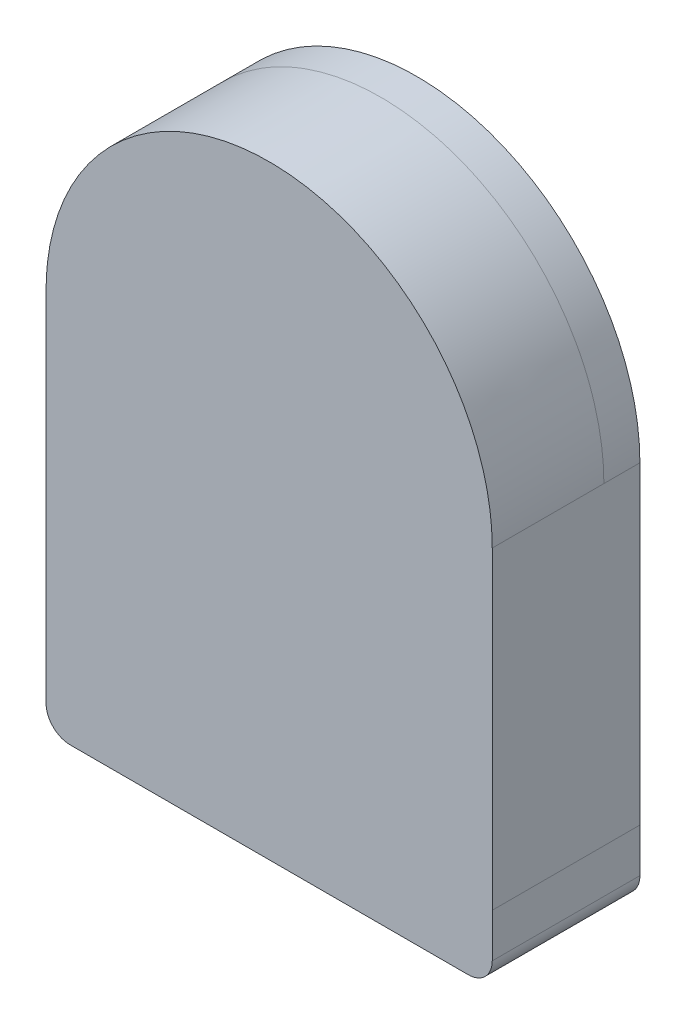
ISO-10303-21;
HEADER;
FILE_DESCRIPTION(('STEP AP214'),'2;1');
FILE_NAME('part.step','',(''),(''),'','','');
FILE_SCHEMA(('AUTOMOTIVE_DESIGN { 1 0 10303 214 1 1 1 1 }'));
ENDSEC;
DATA;
#1=APPLICATION_CONTEXT('core data for automotive mechanical design processes');
#2=APPLICATION_PROTOCOL_DEFINITION('international standard','automotive_design',2000,#1);
#3=PRODUCT_CONTEXT('',#1,'mechanical');
#4=PRODUCT('Part','Part','',(#3));
#5=PRODUCT_RELATED_PRODUCT_CATEGORY('part','',(#4));
#6=PRODUCT_DEFINITION_FORMATION('','',#4);
#7=PRODUCT_DEFINITION_CONTEXT('part definition',#1,'design');
#8=PRODUCT_DEFINITION('design','',#6,#7);
#9=PRODUCT_DEFINITION_SHAPE('','',#8);
#10=(LENGTH_UNIT() NAMED_UNIT(*) SI_UNIT(.MILLI.,.METRE.));
#11=(NAMED_UNIT(*) PLANE_ANGLE_UNIT() SI_UNIT($,.RADIAN.));
#12=(NAMED_UNIT(*) SI_UNIT($,.STERADIAN.) SOLID_ANGLE_UNIT());
#13=UNCERTAINTY_MEASURE_WITH_UNIT(LENGTH_MEASURE(1.E-05),#10,'distance_accuracy_value','');
#14=(GEOMETRIC_REPRESENTATION_CONTEXT(3) GLOBAL_UNCERTAINTY_ASSIGNED_CONTEXT((#13)) GLOBAL_UNIT_ASSIGNED_CONTEXT((#10,
#11,#12)) REPRESENTATION_CONTEXT('',''));
#15=CARTESIAN_POINT('',(0.,0.,0.));
#16=DIRECTION('',(0.,0.,1.));
#17=DIRECTION('',(1.,0.,0.));
#18=AXIS2_PLACEMENT_3D('',#15,#16,#17);
#19=CARTESIAN_POINT('',(8.29127246754,-14.8912724675,3.075));
#20=DIRECTION('',(0.,0.,-1.));
#21=DIRECTION('',(1.,0.,0.));
#22=AXIS2_PLACEMENT_3D('',#19,#20,#21);
#23=CYLINDRICAL_SURFACE('',#22,1.);
#24=CARTESIAN_POINT('',(8.29127246754,-14.8912724675,0.));
#25=DIRECTION('',(0.,0.,1.));
#26=DIRECTION('',(1.,0.,0.));
#27=AXIS2_PLACEMENT_3D('',#24,#25,#26);
#28=CIRCLE('',#27,1.);
#29=CARTESIAN_POINT('',(8.29127246754,-15.8912724675,0.));
#30=VERTEX_POINT('',#29);
#31=CARTESIAN_POINT('',(9.29127246754,-14.8912724675,0.));
#32=VERTEX_POINT('',#31);
#33=EDGE_CURVE('E11',#30,#32,#28,.T.);
#34=ORIENTED_EDGE('',*,*,#33,.T.);
#35=DIRECTION('',(0.,0.,-1.));
#36=VECTOR('',#35,1.);
#37=CARTESIAN_POINT('',(9.29127246754,-14.8912724675,3.075));
#38=LINE('',#37,#36);
#39=CARTESIAN_POINT('',(9.29127246754,-14.8912724675,6.15));
#40=VERTEX_POINT('',#39);
#41=EDGE_CURVE('E207',#40,#32,#38,.T.);
#42=ORIENTED_EDGE('',*,*,#41,.F.);
#43=CARTESIAN_POINT('',(8.29127246754,-14.8912724675,6.15));
#44=DIRECTION('',(0.,0.,-1.));
#45=DIRECTION('',(1.,0.,0.));
#46=AXIS2_PLACEMENT_3D('',#43,#44,#45);
#47=CIRCLE('',#46,1.);
#48=CARTESIAN_POINT('',(8.29127246754,-15.8912724675,6.15));
#49=VERTEX_POINT('',#48);
#50=EDGE_CURVE('E26',#40,#49,#47,.T.);
#51=ORIENTED_EDGE('',*,*,#50,.T.);
#52=DIRECTION('',(0.,0.,-1.));
#53=VECTOR('',#52,1.);
#54=CARTESIAN_POINT('',(8.29127246754,-15.8912724675,3.075));
#55=LINE('',#54,#53);
#56=EDGE_CURVE('E214',#49,#30,#55,.T.);
#57=ORIENTED_EDGE('',*,*,#56,.T.);
#58=EDGE_LOOP('',(#34,#42,#51,#57));
#59=FACE_BOUND('',#58,.T.);
#60=ADVANCED_FACE('F16',(#59),#23,.T.);
#61=CARTESIAN_POINT('',(0.,-3.3,0.));
#62=DIRECTION('',(0.,0.,1.));
#63=DIRECTION('',(1.,0.,0.));
#64=AXIS2_PLACEMENT_3D('',#61,#62,#63);
#65=PLANE('',#64);
#66=ORIENTED_EDGE('',*,*,#33,.F.);
#67=DIRECTION('',(1.,0.,0.));
#68=VECTOR('',#67,1.);
#69=CARTESIAN_POINT('',(6.67750706079,-15.8912724675,0.));
#70=LINE('',#69,#68);
#71=CARTESIAN_POINT('',(5.06374165404,-15.8912724675,0.));
#72=VERTEX_POINT('',#71);
#73=EDGE_CURVE('E203',#72,#30,#70,.T.);
#74=ORIENTED_EDGE('',*,*,#73,.F.);
#75=DIRECTION('',(1.,0.,0.));
#76=VECTOR('',#75,1.);
#77=CARTESIAN_POINT('',(0.00328049456473,-15.8912724675,0.));
#78=LINE('',#77,#76);
#79=CARTESIAN_POINT('',(-5.05718066429,-15.8912724675,0.));
#80=VERTEX_POINT('',#79);
#81=EDGE_CURVE('E161',#80,#72,#78,.T.);
#82=ORIENTED_EDGE('',*,*,#81,.F.);
#83=DIRECTION('',(1.,0.,0.));
#84=VECTOR('',#83,1.);
#85=CARTESIAN_POINT('',(-6.67422656592,-15.8912724675,0.));
#86=LINE('',#85,#84);
#87=CARTESIAN_POINT('',(-8.29127246754,-15.8912724675,0.));
#88=VERTEX_POINT('',#87);
#89=EDGE_CURVE('E156',#88,#80,#86,.T.);
#90=ORIENTED_EDGE('',*,*,#89,.F.);
#91=CARTESIAN_POINT('',(-8.29127246754,-14.8912724675,0.));
#92=DIRECTION('',(0.,0.,1.));
#93=DIRECTION('',(1.,0.,0.));
#94=AXIS2_PLACEMENT_3D('',#91,#92,#93);
#95=CIRCLE('',#94,1.);
#96=CARTESIAN_POINT('',(-9.29127246754,-14.8912724675,0.));
#97=VERTEX_POINT('',#96);
#98=EDGE_CURVE('E266',#97,#88,#95,.T.);
#99=ORIENTED_EDGE('',*,*,#98,.F.);
#100=DIRECTION('',(0.,-1.,0.));
#101=VECTOR('',#100,1.);
#102=CARTESIAN_POINT('',(-9.29127246754,-13.9425119181,0.));
#103=LINE('',#102,#101);
#104=CARTESIAN_POINT('',(-9.29127246754,-12.9937513688,0.));
#105=VERTEX_POINT('',#104);
#106=EDGE_CURVE('E74',#105,#97,#103,.T.);
#107=ORIENTED_EDGE('',*,*,#106,.F.);
#108=DIRECTION('',(0.,1.,0.));
#109=VECTOR('',#108,1.);
#110=CARTESIAN_POINT('',(-9.29127246754,-6.49687568471,0.));
#111=LINE('',#110,#109);
#112=CARTESIAN_POINT('',(-9.29127246754,0.,0.));
#113=VERTEX_POINT('',#112);
#114=EDGE_CURVE('E183',#105,#113,#111,.T.);
#115=ORIENTED_EDGE('',*,*,#114,.T.);
#116=CARTESIAN_POINT('',(0.,0.,0.));
#117=DIRECTION('',(0.,0.,1.));
#118=DIRECTION('',(1.,0.,0.));
#119=AXIS2_PLACEMENT_3D('',#116,#117,#118);
#120=CIRCLE('',#119,9.29127246754);
#121=CARTESIAN_POINT('',(9.29127246754,0.,0.));
#122=VERTEX_POINT('',#121);
#123=EDGE_CURVE('E178',#122,#113,#120,.T.);
#124=ORIENTED_EDGE('',*,*,#123,.F.);
#125=DIRECTION('',(0.,-1.,0.));
#126=VECTOR('',#125,1.);
#127=CARTESIAN_POINT('',(9.29127246754,-6.53289347638,0.));
#128=LINE('',#127,#126);
#129=CARTESIAN_POINT('',(9.29127246754,-13.0657869532,0.));
#130=VERTEX_POINT('',#129);
#131=EDGE_CURVE('E188',#122,#130,#128,.T.);
#132=ORIENTED_EDGE('',*,*,#131,.T.);
#133=DIRECTION('',(0.,1.,0.));
#134=VECTOR('',#133,1.);
#135=CARTESIAN_POINT('',(9.29127246754,-13.9785297104,0.));
#136=LINE('',#135,#134);
#137=EDGE_CURVE('E123',#32,#130,#136,.T.);
#138=ORIENTED_EDGE('',*,*,#137,.F.);
#139=EDGE_LOOP('',(#66,#74,#82,#90,#99,#107,#115,#124,#132,#138));
#140=FACE_BOUND('',#139,.T.);
#141=ADVANCED_FACE('F305',(#140),#65,.F.);
#142=CARTESIAN_POINT('',(0.,0.,6.15));
#143=DIRECTION('',(0.,0.,1.));
#144=DIRECTION('',(1.,0.,0.));
#145=AXIS2_PLACEMENT_3D('',#142,#143,#144);
#146=PLANE('',#145);
#147=DIRECTION('',(0.,1.,0.));
#148=VECTOR('',#147,1.);
#149=CARTESIAN_POINT('',(9.29127246754,-13.9785297104,6.15));
#150=LINE('',#149,#148);
#151=CARTESIAN_POINT('',(9.29127246754,-13.0657869532,6.15));
#152=VERTEX_POINT('',#151);
#153=EDGE_CURVE('E213',#40,#152,#150,.T.);
#154=ORIENTED_EDGE('',*,*,#153,.T.);
#155=DIRECTION('',(0.,1.,0.));
#156=VECTOR('',#155,1.);
#157=CARTESIAN_POINT('',(9.29127246754,-6.53289347666,6.15));
#158=LINE('',#157,#156);
#159=CARTESIAN_POINT('',(9.29127246754,-1.08640207941E-10,6.15));
#160=VERTEX_POINT('',#159);
#161=EDGE_CURVE('E192',#152,#160,#158,.T.);
#162=ORIENTED_EDGE('',*,*,#161,.T.);
#163=CARTESIAN_POINT('',(9.29127246754,-1.0863723428E-10,6.15));
#164=CARTESIAN_POINT('',(9.29127246754,1.45946966633,6.15));
#165=CARTESIAN_POINT('',(9.00470626867,2.91893933265,6.15));
#166=CARTESIAN_POINT('',(8.43129066116,4.30328706918,6.15));
#167=CARTESIAN_POINT('',(6.77255467012,6.77255467012,6.15));
#168=CARTESIAN_POINT('',(4.30328706918,8.43129066116,6.15));
#169=CARTESIAN_POINT('',(2.91893933265,9.00470626867,6.15));
#170=CARTESIAN_POINT('',(0.,9.5778386664,6.15));
#171=CARTESIAN_POINT('',(-2.91893933265,9.00470626867,6.15));
#172=CARTESIAN_POINT('',(-4.30328706918,8.43129066116,6.15));
#173=CARTESIAN_POINT('',(-6.77255467012,6.77255467012,6.15));
#174=CARTESIAN_POINT('',(-8.43129066116,4.30328706918,6.15));
#175=CARTESIAN_POINT('',(-9.00470626867,2.91893933265,6.15));
#176=CARTESIAN_POINT('',(-9.29127246754,1.45946966633,6.15));
#177=CARTESIAN_POINT('',(-9.29127246754,0.,6.15));
#178=(BOUNDED_CURVE() B_SPLINE_CURVE(5,(#163,#164,#165,#166,#167,#168,#169,#170,#171,#172,#173,
#174,#175,#176,#177),.UNSPECIFIED.,.F.,.F.) B_SPLINE_CURVE_WITH_KNOTS((6,3,3,3,6),
(-47.0355013243,-39.7381529927,-32.4408046611,-25.1434563295,-17.8461079978),
.UNSPECIFIED.) CURVE() GEOMETRIC_REPRESENTATION_ITEM() RATIONAL_B_SPLINE_CURVE((1.,1.,1.,1.,1.,
1.,1.,1.,1.,1.,1.,1.,1.,1.,1.)) REPRESENTATION_ITEM(''));
#179=CARTESIAN_POINT('',(-9.29127246754,0.,6.15));
#180=VERTEX_POINT('',#179);
#181=EDGE_CURVE('E182',#160,#180,#178,.T.);
#182=ORIENTED_EDGE('',*,*,#181,.T.);
#183=DIRECTION('',(0.,-1.,0.));
#184=VECTOR('',#183,1.);
#185=CARTESIAN_POINT('',(-9.29127246754,-6.49687568438,6.15));
#186=LINE('',#185,#184);
#187=CARTESIAN_POINT('',(-9.29127246754,-12.9937513688,6.15));
#188=VERTEX_POINT('',#187);
#189=EDGE_CURVE('E208',#180,#188,#186,.T.);
#190=ORIENTED_EDGE('',*,*,#189,.T.);
#191=DIRECTION('',(0.,-1.,0.));
#192=VECTOR('',#191,1.);
#193=CARTESIAN_POINT('',(-9.29127246754,-13.9425119181,6.15));
#194=LINE('',#193,#192);
#195=CARTESIAN_POINT('',(-9.29127246754,-14.8912724675,6.15));
#196=VERTEX_POINT('',#195);
#197=EDGE_CURVE('E59',#188,#196,#194,.T.);
#198=ORIENTED_EDGE('',*,*,#197,.T.);
#199=CARTESIAN_POINT('',(-8.29127246754,-14.8912724675,6.15));
#200=DIRECTION('',(0.,0.,-1.));
#201=DIRECTION('',(1.,0.,0.));
#202=AXIS2_PLACEMENT_3D('',#199,#200,#201);
#203=CIRCLE('',#202,1.);
#204=CARTESIAN_POINT('',(-8.29127246754,-15.8912724675,6.15));
#205=VERTEX_POINT('',#204);
#206=EDGE_CURVE('E204',#205,#196,#203,.T.);
#207=ORIENTED_EDGE('',*,*,#206,.F.);
#208=DIRECTION('',(1.,0.,0.));
#209=VECTOR('',#208,1.);
#210=CARTESIAN_POINT('',(-6.67422656592,-15.8912724675,6.15));
#211=LINE('',#210,#209);
#212=CARTESIAN_POINT('',(-5.05718066429,-15.8912724675,6.15));
#213=VERTEX_POINT('',#212);
#214=EDGE_CURVE('E197',#205,#213,#211,.T.);
#215=ORIENTED_EDGE('',*,*,#214,.T.);
#216=DIRECTION('',(1.,0.,0.));
#217=VECTOR('',#216,1.);
#218=CARTESIAN_POINT('',(0.00328049487454,-15.8912724675,6.15));
#219=LINE('',#218,#217);
#220=CARTESIAN_POINT('',(5.06374165404,-15.8912724675,6.15));
#221=VERTEX_POINT('',#220);
#222=EDGE_CURVE('E166',#213,#221,#219,.T.);
#223=ORIENTED_EDGE('',*,*,#222,.T.);
#224=DIRECTION('',(1.,0.,0.));
#225=VECTOR('',#224,1.);
#226=CARTESIAN_POINT('',(6.67750706079,-15.8912724675,6.15));
#227=LINE('',#226,#225);
#228=EDGE_CURVE('E134',#221,#49,#227,.T.);
#229=ORIENTED_EDGE('',*,*,#228,.T.);
#230=ORIENTED_EDGE('',*,*,#50,.F.);
#231=EDGE_LOOP('',(#154,#162,#182,#190,#198,#207,#215,#223,#229,#230));
#232=FACE_BOUND('',#231,.T.);
#233=ADVANCED_FACE('F313',(#232),#146,.T.);
#234=CARTESIAN_POINT('',(9.29127246754,-13.0657869525,0.));
#235=DIRECTION('',(1.,0.,0.));
#236=DIRECTION('',(0.,-1.,0.));
#237=AXIS2_PLACEMENT_3D('',#234,#235,#236);
#238=PLANE('',#237);
#239=ORIENTED_EDGE('',*,*,#137,.T.);
#240=DIRECTION('',(0.,0.,-1.));
#241=VECTOR('',#240,1.);
#242=CARTESIAN_POINT('',(9.29127246754,-13.0657869525,3.075));
#243=LINE('',#242,#241);
#244=EDGE_CURVE('E187',#152,#130,#243,.T.);
#245=ORIENTED_EDGE('',*,*,#244,.F.);
#246=ORIENTED_EDGE('',*,*,#153,.F.);
#247=ORIENTED_EDGE('',*,*,#41,.T.);
#248=EDGE_LOOP('',(#239,#245,#246,#247));
#249=FACE_BOUND('',#248,.T.);
#250=ADVANCED_FACE('F250',(#249),#238,.T.);
#251=CARTESIAN_POINT('',(-5.0571806643,-15.8912724675,0.));
#252=DIRECTION('',(0.,-1.,0.));
#253=DIRECTION('',(0.,0.,-1.));
#254=AXIS2_PLACEMENT_3D('',#251,#252,#253);
#255=PLANE('',#254);
#256=ORIENTED_EDGE('',*,*,#228,.F.);
#257=DIRECTION('',(0.,0.,-1.));
#258=VECTOR('',#257,1.);
#259=CARTESIAN_POINT('',(5.06374165404,-15.8912724675,3.825));
#260=LINE('',#259,#258);
#261=CARTESIAN_POINT('',(5.06374165404,-15.8912724675,1.5));
#262=VERTEX_POINT('',#261);
#263=EDGE_CURVE('E225',#221,#262,#260,.T.);
#264=ORIENTED_EDGE('',*,*,#263,.T.);
#265=DIRECTION('',(0.,0.,-1.));
#266=VECTOR('',#265,1.);
#267=CARTESIAN_POINT('',(5.06374165343,-15.8912724675,0.75));
#268=LINE('',#267,#266);
#269=EDGE_CURVE('E221',#262,#72,#268,.T.);
#270=ORIENTED_EDGE('',*,*,#269,.T.);
#271=ORIENTED_EDGE('',*,*,#73,.T.);
#272=ORIENTED_EDGE('',*,*,#56,.F.);
#273=EDGE_LOOP('',(#256,#264,#270,#271,#272));
#274=FACE_BOUND('',#273,.T.);
#275=ADVANCED_FACE('F340',(#274),#255,.T.);
#276=CARTESIAN_POINT('',(-8.29127246754,-14.8912724675,3.075));
#277=DIRECTION('',(0.,0.,-1.));
#278=DIRECTION('',(0.,-1.,0.));
#279=AXIS2_PLACEMENT_3D('',#276,#277,#278);
#280=CYLINDRICAL_SURFACE('',#279,1.);
#281=ORIENTED_EDGE('',*,*,#98,.T.);
#282=DIRECTION('',(0.,0.,-1.));
#283=VECTOR('',#282,1.);
#284=CARTESIAN_POINT('',(-8.29127246754,-15.8912724675,3.075));
#285=LINE('',#284,#283);
#286=EDGE_CURVE('E199',#205,#88,#285,.T.);
#287=ORIENTED_EDGE('',*,*,#286,.F.);
#288=ORIENTED_EDGE('',*,*,#206,.T.);
#289=DIRECTION('',(0.,0.,-1.));
#290=VECTOR('',#289,1.);
#291=CARTESIAN_POINT('',(-9.29127246754,-14.8912724675,3.075));
#292=LINE('',#291,#290);
#293=EDGE_CURVE('E193',#196,#97,#292,.T.);
#294=ORIENTED_EDGE('',*,*,#293,.T.);
#295=EDGE_LOOP('',(#281,#287,#288,#294));
#296=FACE_BOUND('',#295,.T.);
#297=ADVANCED_FACE('F348',(#296),#280,.T.);
#298=CARTESIAN_POINT('',(-5.0571806643,-15.8912724675,0.));
#299=DIRECTION('',(0.,-1.,0.));
#300=DIRECTION('',(0.,0.,-1.));
#301=AXIS2_PLACEMENT_3D('',#298,#299,#300);
#302=PLANE('',#301);
#303=ORIENTED_EDGE('',*,*,#89,.T.);
#304=DIRECTION('',(0.,0.,-1.));
#305=VECTOR('',#304,1.);
#306=CARTESIAN_POINT('',(-5.0571806643,-15.8912724675,0.75));
#307=LINE('',#306,#305);
#308=CARTESIAN_POINT('',(-5.0571806643,-15.8912724675,1.5));
#309=VERTEX_POINT('',#308);
#310=EDGE_CURVE('E149',#309,#80,#307,.T.);
#311=ORIENTED_EDGE('',*,*,#310,.F.);
#312=DIRECTION('',(0.,0.,-1.));
#313=VECTOR('',#312,1.);
#314=CARTESIAN_POINT('',(-5.05718066429,-15.8912724675,3.825));
#315=LINE('',#314,#313);
#316=EDGE_CURVE('E153',#213,#309,#315,.T.);
#317=ORIENTED_EDGE('',*,*,#316,.F.);
#318=ORIENTED_EDGE('',*,*,#214,.F.);
#319=ORIENTED_EDGE('',*,*,#286,.T.);
#320=EDGE_LOOP('',(#303,#311,#317,#318,#319));
#321=FACE_BOUND('',#320,.T.);
#322=ADVANCED_FACE('F151',(#321),#302,.T.);
#323=CARTESIAN_POINT('',(-9.29127246754,0.,0.));
#324=DIRECTION('',(-1.,0.,0.));
#325=DIRECTION('',(0.,1.,0.));
#326=AXIS2_PLACEMENT_3D('',#323,#324,#325);
#327=PLANE('',#326);
#328=ORIENTED_EDGE('',*,*,#197,.F.);
#329=DIRECTION('',(0.,0.,-1.));
#330=VECTOR('',#329,1.);
#331=CARTESIAN_POINT('',(-9.29127246754,-12.9937513688,3.075));
#332=LINE('',#331,#330);
#333=EDGE_CURVE('E186',#188,#105,#332,.T.);
#334=ORIENTED_EDGE('',*,*,#333,.T.);
#335=ORIENTED_EDGE('',*,*,#106,.T.);
#336=ORIENTED_EDGE('',*,*,#293,.F.);
#337=EDGE_LOOP('',(#328,#334,#335,#336));
#338=FACE_BOUND('',#337,.T.);
#339=ADVANCED_FACE('F298',(#338),#327,.T.);
#340=CARTESIAN_POINT('',(-9.29127246754,0.,0.));
#341=DIRECTION('',(-1.,0.,0.));
#342=DIRECTION('',(0.,1.,0.));
#343=AXIS2_PLACEMENT_3D('',#340,#341,#342);
#344=PLANE('',#343);
#345=ORIENTED_EDGE('',*,*,#114,.F.);
#346=ORIENTED_EDGE('',*,*,#333,.F.);
#347=ORIENTED_EDGE('',*,*,#189,.F.);
#348=DIRECTION('',(0.,0.,1.));
#349=VECTOR('',#348,1.);
#350=CARTESIAN_POINT('',(-9.29127246754,0.,3.825));
#351=LINE('',#350,#349);
#352=CARTESIAN_POINT('',(-9.29127246754,0.,1.5));
#353=VERTEX_POINT('',#352);
#354=EDGE_CURVE('E288',#353,#180,#351,.T.);
#355=ORIENTED_EDGE('',*,*,#354,.F.);
#356=DIRECTION('',(0.,0.,1.));
#357=VECTOR('',#356,1.);
#358=CARTESIAN_POINT('',(-9.29127246754,0.,0.));
#359=LINE('',#358,#357);
#360=EDGE_CURVE('E173',#113,#353,#359,.T.);
#361=ORIENTED_EDGE('',*,*,#360,.F.);
#362=EDGE_LOOP('',(#345,#346,#347,#355,#361));
#363=FACE_BOUND('',#362,.T.);
#364=ADVANCED_FACE('F302',(#363),#344,.T.);
#365=CARTESIAN_POINT('',(9.29127246754,-13.0657869525,0.));
#366=DIRECTION('',(1.,0.,0.));
#367=DIRECTION('',(0.,-1.,0.));
#368=AXIS2_PLACEMENT_3D('',#365,#366,#367);
#369=PLANE('',#368);
#370=ORIENTED_EDGE('',*,*,#131,.F.);
#371=DIRECTION('',(0.,0.,1.));
#372=VECTOR('',#371,1.);
#373=CARTESIAN_POINT('',(9.29127246754,0.,0.));
#374=LINE('',#373,#372);
#375=CARTESIAN_POINT('',(9.29127246754,-1.08640207941E-10,1.5));
#376=VERTEX_POINT('',#375);
#377=EDGE_CURVE('E168',#122,#376,#374,.T.);
#378=ORIENTED_EDGE('',*,*,#377,.T.);
#379=DIRECTION('',(0.,0.,1.));
#380=VECTOR('',#379,1.);
#381=CARTESIAN_POINT('',(9.29127246754,-1.08633546603E-10,3.825));
#382=LINE('',#381,#380);
#383=EDGE_CURVE('E311',#376,#160,#382,.T.);
#384=ORIENTED_EDGE('',*,*,#383,.T.);
#385=ORIENTED_EDGE('',*,*,#161,.F.);
#386=ORIENTED_EDGE('',*,*,#244,.T.);
#387=EDGE_LOOP('',(#370,#378,#384,#385,#386));
#388=FACE_BOUND('',#387,.T.);
#389=ADVANCED_FACE('F252',(#388),#369,.T.);
#390=CARTESIAN_POINT('',(-5.0571806643,-15.8912724675,0.));
#391=DIRECTION('',(0.,-1.,0.));
#392=DIRECTION('',(0.,0.,-1.));
#393=AXIS2_PLACEMENT_3D('',#390,#391,#392);
#394=PLANE('',#393);
#395=ORIENTED_EDGE('',*,*,#316,.T.);
#396=ORIENTED_EDGE('',*,*,#310,.T.);
#397=ORIENTED_EDGE('',*,*,#81,.T.);
#398=ORIENTED_EDGE('',*,*,#269,.F.);
#399=ORIENTED_EDGE('',*,*,#263,.F.);
#400=ORIENTED_EDGE('',*,*,#222,.F.);
#401=EDGE_LOOP('',(#395,#396,#397,#398,#399,#400));
#402=FACE_BOUND('',#401,.T.);
#403=ADVANCED_FACE('F164',(#402),#394,.T.);
#404=CARTESIAN_POINT('',(0.,0.,0.));
#405=DIRECTION('',(0.,0.,1.));
#406=DIRECTION('',(1.,0.,0.));
#407=AXIS2_PLACEMENT_3D('',#404,#405,#406);
#408=CYLINDRICAL_SURFACE('',#407,9.29127246754);
#409=ORIENTED_EDGE('',*,*,#123,.T.);
#410=ORIENTED_EDGE('',*,*,#360,.T.);
#411=CARTESIAN_POINT('',(9.29127246754,-1.0863723428E-10,1.5));
#412=CARTESIAN_POINT('',(9.29127246754,1.45946966633,1.5));
#413=CARTESIAN_POINT('',(9.00470626867,2.91893933265,1.5));
#414=CARTESIAN_POINT('',(8.43129066116,4.30328706918,1.5));
#415=CARTESIAN_POINT('',(6.77255467012,6.77255467012,1.5));
#416=CARTESIAN_POINT('',(4.30328706918,8.43129066116,1.5));
#417=CARTESIAN_POINT('',(2.91893933265,9.00470626867,1.5));
#418=CARTESIAN_POINT('',(0.,9.5778386664,1.5));
#419=CARTESIAN_POINT('',(-2.91893933265,9.00470626867,1.5));
#420=CARTESIAN_POINT('',(-4.30328706918,8.43129066116,1.5));
#421=CARTESIAN_POINT('',(-6.77255467012,6.77255467012,1.5));
#422=CARTESIAN_POINT('',(-8.43129066116,4.30328706918,1.5));
#423=CARTESIAN_POINT('',(-9.00470626867,2.91893933265,1.5));
#424=CARTESIAN_POINT('',(-9.29127246754,1.45946966633,1.5));
#425=CARTESIAN_POINT('',(-9.29127246754,0.,1.5));
#426=(BOUNDED_CURVE() B_SPLINE_CURVE(5,(#411,#412,#413,#414,#415,#416,#417,#418,#419,#420,#421,
#422,#423,#424,#425),.UNSPECIFIED.,.F.,.F.) B_SPLINE_CURVE_WITH_KNOTS((6,3,3,3,6),(0.,
7.433822163,14.8676443261,22.30146648915,29.7352886522),
.UNSPECIFIED.) CURVE() GEOMETRIC_REPRESENTATION_ITEM() RATIONAL_B_SPLINE_CURVE((1.,1.,1.,1.,1.,
1.,1.,1.,1.,1.,1.,1.,1.,1.,1.)) REPRESENTATION_ITEM(''));
#427=EDGE_CURVE('E232',#376,#353,#426,.T.);
#428=ORIENTED_EDGE('',*,*,#427,.F.);
#429=ORIENTED_EDGE('',*,*,#377,.F.);
#430=EDGE_LOOP('',(#409,#410,#428,#429));
#431=FACE_BOUND('',#430,.T.);
#432=ADVANCED_FACE('F249',(#431),#408,.T.);
#433=CARTESIAN_POINT('',(-9.29127246754,0.,1.5));
#434=CARTESIAN_POINT('',(-9.29127246754,1.45946966633,1.5));
#435=CARTESIAN_POINT('',(-9.00470626867,2.91893933265,1.5));
#436=CARTESIAN_POINT('',(-8.43129066116,4.30328706918,1.5));
#437=CARTESIAN_POINT('',(-6.77255467012,6.77255467012,1.5));
#438=CARTESIAN_POINT('',(-4.30328706918,8.43129066116,1.5));
#439=CARTESIAN_POINT('',(-2.91893933265,9.00470626867,1.5));
#440=CARTESIAN_POINT('',(0.,9.5778386664,1.5));
#441=CARTESIAN_POINT('',(2.91893933265,9.00470626867,1.5));
#442=CARTESIAN_POINT('',(4.30328706918,8.43129066116,1.5));
#443=CARTESIAN_POINT('',(6.77255467012,6.77255467012,1.5));
#444=CARTESIAN_POINT('',(8.43129066116,4.30328706918,1.5));
#445=CARTESIAN_POINT('',(9.00470626867,2.91893933265,1.5));
#446=CARTESIAN_POINT('',(9.29127246754,1.45946966633,1.5));
#447=CARTESIAN_POINT('',(9.29127246754,-1.0863723428E-10,1.5));
#448=(BOUNDED_CURVE() B_SPLINE_CURVE(5,(#433,#434,#435,#436,#437,#438,#439,#440,#441,#442,#443,
#444,#445,#446,#447),.UNSPECIFIED.,.F.,.F.) B_SPLINE_CURVE_WITH_KNOTS((6,3,3,3,6),(0.,
7.43382216305,14.8676443261,22.3014664892,29.7352886522),
.UNSPECIFIED.) CURVE() GEOMETRIC_REPRESENTATION_ITEM() RATIONAL_B_SPLINE_CURVE((1.,1.,1.,1.,1.,
1.,1.,1.,1.,1.,1.,1.,1.,1.,1.)) REPRESENTATION_ITEM(''));
#449=DIRECTION('',(0.,0.,1.));
#450=VECTOR('',#449,1.);
#451=SURFACE_OF_LINEAR_EXTRUSION('',#448,#450);
#452=ORIENTED_EDGE('',*,*,#383,.F.);
#453=ORIENTED_EDGE('',*,*,#427,.T.);
#454=ORIENTED_EDGE('',*,*,#354,.T.);
#455=ORIENTED_EDGE('',*,*,#181,.F.);
#456=EDGE_LOOP('',(#452,#453,#454,#455));
#457=FACE_BOUND('',#456,.T.);
#458=ADVANCED_FACE('F238',(#457),#451,.F.);
#459=CLOSED_SHELL('',(#60,#141,#233,#250,#275,#297,#322,#339,#364,#389,#403,#432,#458));
#460=MANIFOLD_SOLID_BREP('B1',#459);
#461=ADVANCED_BREP_SHAPE_REPRESENTATION('',(#18,#460),#14);
#462=SHAPE_DEFINITION_REPRESENTATION(#9,#461);
ENDSEC;
END-ISO-10303-21;
